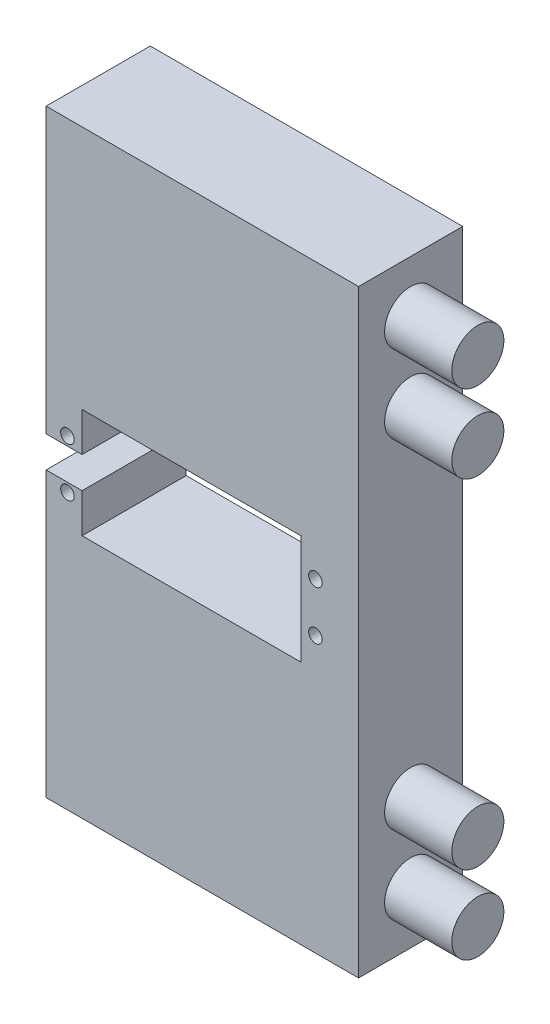
ISO-10303-21;
HEADER;
FILE_DESCRIPTION(('STEP AP214'),'2;1');
FILE_NAME('part.step','',(''),(''),'','','');
FILE_SCHEMA(('AUTOMOTIVE_DESIGN { 1 0 10303 214 1 1 1 1 }'));
ENDSEC;
DATA;
#1=APPLICATION_CONTEXT('core data for automotive mechanical design processes');
#2=APPLICATION_PROTOCOL_DEFINITION('international standard','automotive_design',2000,#1);
#3=PRODUCT_CONTEXT('',#1,'mechanical');
#4=PRODUCT('Part','Part','',(#3));
#5=PRODUCT_RELATED_PRODUCT_CATEGORY('part','',(#4));
#6=PRODUCT_DEFINITION_FORMATION('','',#4);
#7=PRODUCT_DEFINITION_CONTEXT('part definition',#1,'design');
#8=PRODUCT_DEFINITION('design','',#6,#7);
#9=PRODUCT_DEFINITION_SHAPE('','',#8);
#10=(LENGTH_UNIT() NAMED_UNIT(*) SI_UNIT(.MILLI.,.METRE.));
#11=(NAMED_UNIT(*) PLANE_ANGLE_UNIT() SI_UNIT($,.RADIAN.));
#12=(NAMED_UNIT(*) SI_UNIT($,.STERADIAN.) SOLID_ANGLE_UNIT());
#13=UNCERTAINTY_MEASURE_WITH_UNIT(LENGTH_MEASURE(1.E-05),#10,'distance_accuracy_value','');
#14=(GEOMETRIC_REPRESENTATION_CONTEXT(3) GLOBAL_UNCERTAINTY_ASSIGNED_CONTEXT((#13)) GLOBAL_UNIT_ASSIGNED_CONTEXT((#10,
#11,#12)) REPRESENTATION_CONTEXT('',''));
#15=CARTESIAN_POINT('',(0.,0.,0.));
#16=DIRECTION('',(0.,0.,1.));
#17=DIRECTION('',(1.,0.,0.));
#18=AXIS2_PLACEMENT_3D('',#15,#16,#17);
#19=CARTESIAN_POINT('',(55.0953192291233,54.5,20.));
#20=DIRECTION('',(1.,0.,0.));
#21=DIRECTION('',(0.,1.,0.));
#22=AXIS2_PLACEMENT_3D('',#19,#20,#21);
#23=PLANE('',#22);
#24=DIRECTION('',(0.,0.,1.));
#25=VECTOR('',#24,1.);
#26=CARTESIAN_POINT('',(55.0953192291233,-6.,20.));
#27=LINE('',#26,#25);
#28=CARTESIAN_POINT('',(55.0953192291233,-6.,0.));
#29=VERTEX_POINT('',#28);
#30=CARTESIAN_POINT('',(55.0953192291233,-6.,20.));
#31=VERTEX_POINT('',#30);
#32=EDGE_CURVE('E208',#29,#31,#27,.T.);
#33=ORIENTED_EDGE('',*,*,#32,.F.);
#34=DIRECTION('',(0.,-1.,0.));
#35=VECTOR('',#34,1.);
#36=CARTESIAN_POINT('',(55.0953192291233,54.5,0.));
#37=LINE('',#36,#35);
#38=CARTESIAN_POINT('',(55.0953192291233,-60.5,0.));
#39=VERTEX_POINT('',#38);
#40=EDGE_CURVE('E285',#29,#39,#37,.T.);
#41=ORIENTED_EDGE('',*,*,#40,.T.);
#42=DIRECTION('',(0.,0.,-1.));
#43=VECTOR('',#42,1.);
#44=CARTESIAN_POINT('',(55.0953192291233,-60.5,20.));
#45=LINE('',#44,#43);
#46=CARTESIAN_POINT('',(55.0953192291233,-60.5,20.));
#47=VERTEX_POINT('',#46);
#48=EDGE_CURVE('E319',#47,#39,#45,.T.);
#49=ORIENTED_EDGE('',*,*,#48,.F.);
#50=DIRECTION('',(0.,-1.,0.));
#51=VECTOR('',#50,1.);
#52=CARTESIAN_POINT('',(55.0953192291233,54.5,20.));
#53=LINE('',#52,#51);
#54=EDGE_CURVE('E156',#31,#47,#53,.T.);
#55=ORIENTED_EDGE('',*,*,#54,.F.);
#56=EDGE_LOOP('',(#33,#41,#49,#55));
#57=FACE_BOUND('',#56,.T.);
#58=ADVANCED_FACE('F103',(#57),#23,.F.);
#59=CARTESIAN_POINT('',(0.,0.,20.));
#60=DIRECTION('',(0.,0.,1.));
#61=DIRECTION('',(1.,0.,0.));
#62=AXIS2_PLACEMENT_3D('',#59,#60,#61);
#63=PLANE('',#62);
#64=CARTESIAN_POINT('',(106.81,1.7,20.));
#65=DIRECTION('',(0.,0.,1.));
#66=DIRECTION('',(1.,0.,0.));
#67=AXIS2_PLACEMENT_3D('',#64,#65,#66);
#68=CIRCLE('',#67,1.29999999999999);
#69=CARTESIAN_POINT('',(108.11,1.7,20.));
#70=VERTEX_POINT('',#69);
#71=EDGE_CURVE('E694',#70,#70,#68,.T.);
#72=ORIENTED_EDGE('',*,*,#71,.F.);
#73=EDGE_LOOP('',(#72));
#74=FACE_BOUND('',#73,.T.);
#75=DIRECTION('',(0.,-1.,0.));
#76=VECTOR('',#75,1.);
#77=CARTESIAN_POINT('',(62.,-6.,20.));
#78=LINE('',#77,#76);
#79=CARTESIAN_POINT('',(62.,-6.,20.));
#80=VERTEX_POINT('',#79);
#81=CARTESIAN_POINT('',(62.,-13.5,20.));
#82=VERTEX_POINT('',#81);
#83=EDGE_CURVE('E211',#80,#82,#78,.T.);
#84=ORIENTED_EDGE('',*,*,#83,.F.);
#85=DIRECTION('',(1.,0.,0.));
#86=VECTOR('',#85,1.);
#87=CARTESIAN_POINT('',(55.,-6.,20.));
#88=LINE('',#87,#86);
#89=EDGE_CURVE('E202',#31,#80,#88,.T.);
#90=ORIENTED_EDGE('',*,*,#89,.F.);
#91=ORIENTED_EDGE('',*,*,#54,.T.);
#92=DIRECTION('',(1.,0.,0.));
#93=VECTOR('',#92,1.);
#94=CARTESIAN_POINT('',(55.0953192291233,-60.5,20.));
#95=LINE('',#94,#93);
#96=CARTESIAN_POINT('',(115.095319229123,-60.5,20.));
#97=VERTEX_POINT('',#96);
#98=EDGE_CURVE('E289',#47,#97,#95,.T.);
#99=ORIENTED_EDGE('',*,*,#98,.T.);
#100=DIRECTION('',(0.,1.,0.));
#101=VECTOR('',#100,1.);
#102=CARTESIAN_POINT('',(115.095319229123,54.5,20.));
#103=LINE('',#102,#101);
#104=CARTESIAN_POINT('',(115.095319229123,54.5,20.));
#105=VERTEX_POINT('',#104);
#106=EDGE_CURVE('E292',#97,#105,#103,.T.);
#107=ORIENTED_EDGE('',*,*,#106,.T.);
#108=DIRECTION('',(-1.,0.,0.));
#109=VECTOR('',#108,1.);
#110=CARTESIAN_POINT('',(55.0953192291233,54.5,20.));
#111=LINE('',#110,#109);
#112=CARTESIAN_POINT('',(55.0953192291233,54.5,20.));
#113=VERTEX_POINT('',#112);
#114=EDGE_CURVE('E128',#105,#113,#111,.T.);
#115=ORIENTED_EDGE('',*,*,#114,.T.);
#116=CARTESIAN_POINT('',(55.0953192291233,0.,20.));
#117=VERTEX_POINT('',#116);
#118=EDGE_CURVE('E286',#113,#117,#53,.T.);
#119=ORIENTED_EDGE('',*,*,#118,.T.);
#120=DIRECTION('',(1.,0.,0.));
#121=VECTOR('',#120,1.);
#122=CARTESIAN_POINT('',(55.,0.,20.));
#123=LINE('',#122,#121);
#124=CARTESIAN_POINT('',(62.,0.,20.));
#125=VERTEX_POINT('',#124);
#126=EDGE_CURVE('E244',#117,#125,#123,.T.);
#127=ORIENTED_EDGE('',*,*,#126,.T.);
#128=DIRECTION('',(0.,1.,0.));
#129=VECTOR('',#128,1.);
#130=CARTESIAN_POINT('',(62.,0.,20.));
#131=LINE('',#130,#129);
#132=CARTESIAN_POINT('',(62.,7.5,20.));
#133=VERTEX_POINT('',#132);
#134=EDGE_CURVE('E240',#125,#133,#131,.T.);
#135=ORIENTED_EDGE('',*,*,#134,.T.);
#136=DIRECTION('',(1.,0.,0.));
#137=VECTOR('',#136,1.);
#138=CARTESIAN_POINT('',(62.,7.5,20.));
#139=LINE('',#138,#137);
#140=CARTESIAN_POINT('',(104.,7.5,20.));
#141=VERTEX_POINT('',#140);
#142=EDGE_CURVE('E236',#133,#141,#139,.T.);
#143=ORIENTED_EDGE('',*,*,#142,.T.);
#144=DIRECTION('',(0.,-1.,0.));
#145=VECTOR('',#144,1.);
#146=CARTESIAN_POINT('',(104.,7.5,20.));
#147=LINE('',#146,#145);
#148=CARTESIAN_POINT('',(104.,-13.5,20.));
#149=VERTEX_POINT('',#148);
#150=EDGE_CURVE('E230',#141,#149,#147,.T.);
#151=ORIENTED_EDGE('',*,*,#150,.T.);
#152=DIRECTION('',(1.,0.,0.));
#153=VECTOR('',#152,1.);
#154=CARTESIAN_POINT('',(62.,-13.5,20.));
#155=LINE('',#154,#153);
#156=EDGE_CURVE('E226',#82,#149,#155,.T.);
#157=ORIENTED_EDGE('',*,*,#156,.F.);
#158=EDGE_LOOP('',(#84,#90,#91,#99,#107,#115,#119,#127,#135,#143,#151,#157));
#159=FACE_BOUND('',#158,.T.);
#160=CARTESIAN_POINT('',(106.81,-7.7,20.));
#161=DIRECTION('',(0.,0.,-1.));
#162=DIRECTION('',(-1.,0.,0.));
#163=AXIS2_PLACEMENT_3D('',#160,#161,#162);
#164=CIRCLE('',#163,1.29999999999999);
#165=CARTESIAN_POINT('',(105.51,-7.7,20.));
#166=VERTEX_POINT('',#165);
#167=EDGE_CURVE('E702',#166,#166,#164,.T.);
#168=ORIENTED_EDGE('',*,*,#167,.T.);
#169=EDGE_LOOP('',(#168));
#170=FACE_BOUND('',#169,.T.);
#171=CARTESIAN_POINT('',(59.19,-7.7,20.));
#172=DIRECTION('',(0.,0.,-1.));
#173=DIRECTION('',(-1.,0.,0.));
#174=AXIS2_PLACEMENT_3D('',#171,#172,#173);
#175=CIRCLE('',#174,1.3);
#176=CARTESIAN_POINT('',(57.89,-7.7,20.));
#177=VERTEX_POINT('',#176);
#178=EDGE_CURVE('E710',#177,#177,#175,.T.);
#179=ORIENTED_EDGE('',*,*,#178,.T.);
#180=EDGE_LOOP('',(#179));
#181=FACE_BOUND('',#180,.T.);
#182=CARTESIAN_POINT('',(59.19,1.7,20.));
#183=DIRECTION('',(0.,0.,1.));
#184=DIRECTION('',(1.,0.,0.));
#185=AXIS2_PLACEMENT_3D('',#182,#183,#184);
#186=CIRCLE('',#185,1.3);
#187=CARTESIAN_POINT('',(60.49,1.7,20.));
#188=VERTEX_POINT('',#187);
#189=EDGE_CURVE('E690',#188,#188,#186,.T.);
#190=ORIENTED_EDGE('',*,*,#189,.F.);
#191=EDGE_LOOP('',(#190));
#192=FACE_BOUND('',#191,.T.);
#193=ADVANCED_FACE('F223',(#74,#159,#170,#181,#192),#63,.T.);
#194=CARTESIAN_POINT('',(0.,0.,0.));
#195=DIRECTION('',(0.,0.,1.));
#196=DIRECTION('',(1.,0.,0.));
#197=AXIS2_PLACEMENT_3D('',#194,#195,#196);
#198=PLANE('',#197);
#199=CARTESIAN_POINT('',(85.,-43.5,0.));
#200=DIRECTION('',(0.,0.,-1.));
#201=DIRECTION('',(-1.,0.,0.));
#202=AXIS2_PLACEMENT_3D('',#199,#200,#201);
#203=CIRCLE('',#202,9.5);
#204=CARTESIAN_POINT('',(75.5,-43.5,0.));
#205=VERTEX_POINT('',#204);
#206=EDGE_CURVE('E661',#205,#205,#203,.T.);
#207=ORIENTED_EDGE('',*,*,#206,.F.);
#208=EDGE_LOOP('',(#207));
#209=FACE_BOUND('',#208,.T.);
#210=CARTESIAN_POINT('',(85.,37.5,0.));
#211=DIRECTION('',(0.,0.,1.));
#212=DIRECTION('',(1.,0.,0.));
#213=AXIS2_PLACEMENT_3D('',#210,#211,#212);
#214=CIRCLE('',#213,9.5);
#215=CARTESIAN_POINT('',(94.5,37.5,0.));
#216=VERTEX_POINT('',#215);
#217=EDGE_CURVE('E660',#216,#216,#214,.T.);
#218=ORIENTED_EDGE('',*,*,#217,.T.);
#219=EDGE_LOOP('',(#218));
#220=FACE_BOUND('',#219,.T.);
#221=CARTESIAN_POINT('',(59.19,-7.7,0.));
#222=DIRECTION('',(0.,0.,-1.));
#223=DIRECTION('',(-1.,0.,0.));
#224=AXIS2_PLACEMENT_3D('',#221,#222,#223);
#225=CIRCLE('',#224,1.3);
#226=CARTESIAN_POINT('',(57.89,-7.7,0.));
#227=VERTEX_POINT('',#226);
#228=EDGE_CURVE('E706',#227,#227,#225,.T.);
#229=ORIENTED_EDGE('',*,*,#228,.F.);
#230=EDGE_LOOP('',(#229));
#231=FACE_BOUND('',#230,.T.);
#232=CARTESIAN_POINT('',(106.81,-7.7,0.));
#233=DIRECTION('',(0.,0.,-1.));
#234=DIRECTION('',(-1.,0.,0.));
#235=AXIS2_PLACEMENT_3D('',#232,#233,#234);
#236=CIRCLE('',#235,1.29999999999999);
#237=CARTESIAN_POINT('',(105.51,-7.7,0.));
#238=VERTEX_POINT('',#237);
#239=EDGE_CURVE('E698',#238,#238,#236,.T.);
#240=ORIENTED_EDGE('',*,*,#239,.F.);
#241=EDGE_LOOP('',(#240));
#242=FACE_BOUND('',#241,.T.);
#243=DIRECTION('',(-1.,0.,0.));
#244=VECTOR('',#243,1.);
#245=CARTESIAN_POINT('',(0.,-6.,0.));
#246=LINE('',#245,#244);
#247=CARTESIAN_POINT('',(62.,-6.,0.));
#248=VERTEX_POINT('',#247);
#249=EDGE_CURVE('E326',#248,#29,#246,.T.);
#250=ORIENTED_EDGE('',*,*,#249,.F.);
#251=DIRECTION('',(0.,-1.,0.));
#252=VECTOR('',#251,1.);
#253=CARTESIAN_POINT('',(62.,-6.,0.));
#254=LINE('',#253,#252);
#255=CARTESIAN_POINT('',(62.,-13.5,0.));
#256=VERTEX_POINT('',#255);
#257=EDGE_CURVE('E218',#248,#256,#254,.T.);
#258=ORIENTED_EDGE('',*,*,#257,.T.);
#259=DIRECTION('',(1.,0.,0.));
#260=VECTOR('',#259,1.);
#261=CARTESIAN_POINT('',(62.,-13.5,0.));
#262=LINE('',#261,#260);
#263=CARTESIAN_POINT('',(104.,-13.5,0.));
#264=VERTEX_POINT('',#263);
#265=EDGE_CURVE('E251',#256,#264,#262,.T.);
#266=ORIENTED_EDGE('',*,*,#265,.T.);
#267=DIRECTION('',(0.,-1.,0.));
#268=VECTOR('',#267,1.);
#269=CARTESIAN_POINT('',(104.,7.5,0.));
#270=LINE('',#269,#268);
#271=CARTESIAN_POINT('',(104.,7.5,0.));
#272=VERTEX_POINT('',#271);
#273=EDGE_CURVE('E256',#272,#264,#270,.T.);
#274=ORIENTED_EDGE('',*,*,#273,.F.);
#275=DIRECTION('',(1.,0.,0.));
#276=VECTOR('',#275,1.);
#277=CARTESIAN_POINT('',(62.,7.5,0.));
#278=LINE('',#277,#276);
#279=CARTESIAN_POINT('',(62.,7.5,0.));
#280=VERTEX_POINT('',#279);
#281=EDGE_CURVE('E260',#280,#272,#278,.T.);
#282=ORIENTED_EDGE('',*,*,#281,.F.);
#283=DIRECTION('',(0.,1.,0.));
#284=VECTOR('',#283,1.);
#285=CARTESIAN_POINT('',(62.,0.,0.));
#286=LINE('',#285,#284);
#287=CARTESIAN_POINT('',(62.,0.,0.));
#288=VERTEX_POINT('',#287);
#289=EDGE_CURVE('E212',#288,#280,#286,.T.);
#290=ORIENTED_EDGE('',*,*,#289,.F.);
#291=DIRECTION('',(-1.,0.,0.));
#292=VECTOR('',#291,1.);
#293=CARTESIAN_POINT('',(0.,0.,0.));
#294=LINE('',#293,#292);
#295=CARTESIAN_POINT('',(55.0953192291233,0.,0.));
#296=VERTEX_POINT('',#295);
#297=EDGE_CURVE('E323',#288,#296,#294,.T.);
#298=ORIENTED_EDGE('',*,*,#297,.T.);
#299=CARTESIAN_POINT('',(55.0953192291233,54.5,0.));
#300=VERTEX_POINT('',#299);
#301=EDGE_CURVE('E298',#300,#296,#37,.T.);
#302=ORIENTED_EDGE('',*,*,#301,.F.);
#303=DIRECTION('',(-1.,0.,0.));
#304=VECTOR('',#303,1.);
#305=CARTESIAN_POINT('',(55.0953192291233,54.5,0.));
#306=LINE('',#305,#304);
#307=CARTESIAN_POINT('',(115.095319229123,54.5,0.));
#308=VERTEX_POINT('',#307);
#309=EDGE_CURVE('E149',#308,#300,#306,.T.);
#310=ORIENTED_EDGE('',*,*,#309,.F.);
#311=DIRECTION('',(0.,1.,0.));
#312=VECTOR('',#311,1.);
#313=CARTESIAN_POINT('',(115.095319229123,54.5,0.));
#314=LINE('',#313,#312);
#315=CARTESIAN_POINT('',(115.095319229123,-60.5,0.));
#316=VERTEX_POINT('',#315);
#317=EDGE_CURVE('E305',#316,#308,#314,.T.);
#318=ORIENTED_EDGE('',*,*,#317,.F.);
#319=DIRECTION('',(1.,0.,0.));
#320=VECTOR('',#319,1.);
#321=CARTESIAN_POINT('',(55.0953192291233,-60.5,0.));
#322=LINE('',#321,#320);
#323=EDGE_CURVE('E302',#39,#316,#322,.T.);
#324=ORIENTED_EDGE('',*,*,#323,.F.);
#325=ORIENTED_EDGE('',*,*,#40,.F.);
#326=EDGE_LOOP('',(#250,#258,#266,#274,#282,#290,#298,#302,#310,#318,#324,#325));
#327=FACE_BOUND('',#326,.T.);
#328=CARTESIAN_POINT('',(106.81,1.7,0.));
#329=DIRECTION('',(0.,0.,1.));
#330=DIRECTION('',(1.,0.,0.));
#331=AXIS2_PLACEMENT_3D('',#328,#329,#330);
#332=CIRCLE('',#331,1.29999999999999);
#333=CARTESIAN_POINT('',(108.11,1.7,0.));
#334=VERTEX_POINT('',#333);
#335=EDGE_CURVE('E252',#334,#334,#332,.T.);
#336=ORIENTED_EDGE('',*,*,#335,.T.);
#337=EDGE_LOOP('',(#336));
#338=FACE_BOUND('',#337,.T.);
#339=CARTESIAN_POINT('',(59.19,1.7,0.));
#340=DIRECTION('',(0.,0.,1.));
#341=DIRECTION('',(1.,0.,0.));
#342=AXIS2_PLACEMENT_3D('',#339,#340,#341);
#343=CIRCLE('',#342,1.3);
#344=CARTESIAN_POINT('',(60.49,1.7,0.));
#345=VERTEX_POINT('',#344);
#346=EDGE_CURVE('E714',#345,#345,#343,.T.);
#347=ORIENTED_EDGE('',*,*,#346,.T.);
#348=EDGE_LOOP('',(#347));
#349=FACE_BOUND('',#348,.T.);
#350=ADVANCED_FACE('F360',(#209,#220,#231,#242,#327,#338,#349),#198,.F.);
#351=ORIENTED_EDGE('',*,*,#301,.T.);
#352=DIRECTION('',(0.,0.,1.));
#353=VECTOR('',#352,1.);
#354=CARTESIAN_POINT('',(55.0953192291233,0.,20.));
#355=LINE('',#354,#353);
#356=EDGE_CURVE('E119',#296,#117,#355,.T.);
#357=ORIENTED_EDGE('',*,*,#356,.T.);
#358=ORIENTED_EDGE('',*,*,#118,.F.);
#359=DIRECTION('',(0.,0.,-1.));
#360=VECTOR('',#359,1.);
#361=CARTESIAN_POINT('',(55.0953192291233,54.5,20.));
#362=LINE('',#361,#360);
#363=EDGE_CURVE('E297',#113,#300,#362,.T.);
#364=ORIENTED_EDGE('',*,*,#363,.T.);
#365=EDGE_LOOP('',(#351,#357,#358,#364));
#366=FACE_BOUND('',#365,.T.);
#367=ADVANCED_FACE('F105',(#366),#23,.F.);
#368=CARTESIAN_POINT('',(55.0953192291233,-60.5,20.));
#369=DIRECTION('',(0.,1.,0.));
#370=DIRECTION('',(-1.,0.,0.));
#371=AXIS2_PLACEMENT_3D('',#368,#369,#370);
#372=PLANE('',#371);
#373=ORIENTED_EDGE('',*,*,#323,.T.);
#374=DIRECTION('',(0.,0.,-1.));
#375=VECTOR('',#374,1.);
#376=CARTESIAN_POINT('',(115.095319229123,-60.5,20.));
#377=LINE('',#376,#375);
#378=EDGE_CURVE('E315',#97,#316,#377,.T.);
#379=ORIENTED_EDGE('',*,*,#378,.F.);
#380=ORIENTED_EDGE('',*,*,#98,.F.);
#381=ORIENTED_EDGE('',*,*,#48,.T.);
#382=EDGE_LOOP('',(#373,#379,#380,#381));
#383=FACE_BOUND('',#382,.T.);
#384=ADVANCED_FACE('F346',(#383),#372,.F.);
#385=CARTESIAN_POINT('',(115.095319229123,54.5,20.));
#386=DIRECTION('',(-1.,0.,0.));
#387=DIRECTION('',(0.,-1.,0.));
#388=AXIS2_PLACEMENT_3D('',#385,#386,#387);
#389=PLANE('',#388);
#390=CARTESIAN_POINT('',(115.095319229123,-50.5,10.));
#391=DIRECTION('',(-1.,0.,0.));
#392=DIRECTION('',(0.,-1.,0.));
#393=AXIS2_PLACEMENT_3D('',#390,#391,#392);
#394=CIRCLE('',#393,5.);
#395=CARTESIAN_POINT('',(115.095319229123,-55.5,10.));
#396=VERTEX_POINT('',#395);
#397=EDGE_CURVE('E12',#396,#396,#394,.F.);
#398=ORIENTED_EDGE('',*,*,#397,.F.);
#399=EDGE_LOOP('',(#398));
#400=FACE_BOUND('',#399,.T.);
#401=CARTESIAN_POINT('',(115.095319229123,-35.5,10.));
#402=DIRECTION('',(-1.,0.,0.));
#403=DIRECTION('',(0.,-1.,0.));
#404=AXIS2_PLACEMENT_3D('',#401,#402,#403);
#405=CIRCLE('',#404,5.);
#406=CARTESIAN_POINT('',(115.095319229123,-40.5,10.));
#407=VERTEX_POINT('',#406);
#408=EDGE_CURVE('E112',#407,#407,#405,.F.);
#409=ORIENTED_EDGE('',*,*,#408,.F.);
#410=EDGE_LOOP('',(#409));
#411=FACE_BOUND('',#410,.T.);
#412=CARTESIAN_POINT('',(115.095319229123,29.5,10.));
#413=DIRECTION('',(-1.,0.,0.));
#414=DIRECTION('',(0.,-1.,0.));
#415=AXIS2_PLACEMENT_3D('',#412,#413,#414);
#416=CIRCLE('',#415,5.);
#417=CARTESIAN_POINT('',(115.095319229123,24.5,10.));
#418=VERTEX_POINT('',#417);
#419=EDGE_CURVE('E333',#418,#418,#416,.F.);
#420=ORIENTED_EDGE('',*,*,#419,.F.);
#421=EDGE_LOOP('',(#420));
#422=FACE_BOUND('',#421,.T.);
#423=CARTESIAN_POINT('',(115.095319229123,44.5,10.));
#424=DIRECTION('',(-1.,0.,0.));
#425=DIRECTION('',(0.,-1.,0.));
#426=AXIS2_PLACEMENT_3D('',#423,#424,#425);
#427=CIRCLE('',#426,5.);
#428=CARTESIAN_POINT('',(115.095319229123,39.5,10.));
#429=VERTEX_POINT('',#428);
#430=EDGE_CURVE('E329',#429,#429,#427,.F.);
#431=ORIENTED_EDGE('',*,*,#430,.F.);
#432=EDGE_LOOP('',(#431));
#433=FACE_BOUND('',#432,.T.);
#434=ORIENTED_EDGE('',*,*,#317,.T.);
#435=DIRECTION('',(0.,0.,-1.));
#436=VECTOR('',#435,1.);
#437=CARTESIAN_POINT('',(115.095319229123,54.5,20.));
#438=LINE('',#437,#436);
#439=EDGE_CURVE('E312',#105,#308,#438,.T.);
#440=ORIENTED_EDGE('',*,*,#439,.F.);
#441=ORIENTED_EDGE('',*,*,#106,.F.);
#442=ORIENTED_EDGE('',*,*,#378,.T.);
#443=EDGE_LOOP('',(#434,#440,#441,#442));
#444=FACE_BOUND('',#443,.T.);
#445=ADVANCED_FACE('F342',(#400,#411,#422,#433,#444),#389,.F.);
#446=CARTESIAN_POINT('',(55.0953192291233,54.5,20.));
#447=DIRECTION('',(0.,-1.,0.));
#448=DIRECTION('',(0.,0.,-1.));
#449=AXIS2_PLACEMENT_3D('',#446,#447,#448);
#450=PLANE('',#449);
#451=ORIENTED_EDGE('',*,*,#309,.T.);
#452=ORIENTED_EDGE('',*,*,#363,.F.);
#453=ORIENTED_EDGE('',*,*,#114,.F.);
#454=ORIENTED_EDGE('',*,*,#439,.T.);
#455=EDGE_LOOP('',(#451,#452,#453,#454));
#456=FACE_BOUND('',#455,.T.);
#457=ADVANCED_FACE('F345',(#456),#450,.F.);
#458=CARTESIAN_POINT('',(55.,-6.,20.));
#459=DIRECTION('',(0.,1.,0.));
#460=DIRECTION('',(0.,0.,1.));
#461=AXIS2_PLACEMENT_3D('',#458,#459,#460);
#462=PLANE('',#461);
#463=ORIENTED_EDGE('',*,*,#32,.T.);
#464=ORIENTED_EDGE('',*,*,#89,.T.);
#465=DIRECTION('',(0.,0.,-1.));
#466=VECTOR('',#465,1.);
#467=CARTESIAN_POINT('',(62.,-6.,20.));
#468=LINE('',#467,#466);
#469=EDGE_CURVE('E205',#80,#248,#468,.T.);
#470=ORIENTED_EDGE('',*,*,#469,.T.);
#471=ORIENTED_EDGE('',*,*,#249,.T.);
#472=EDGE_LOOP('',(#463,#464,#470,#471));
#473=FACE_BOUND('',#472,.T.);
#474=ADVANCED_FACE('F204',(#473),#462,.T.);
#475=CARTESIAN_POINT('',(55.,0.,20.));
#476=DIRECTION('',(0.,1.,0.));
#477=DIRECTION('',(0.,0.,1.));
#478=AXIS2_PLACEMENT_3D('',#475,#476,#477);
#479=PLANE('',#478);
#480=ORIENTED_EDGE('',*,*,#297,.F.);
#481=DIRECTION('',(0.,0.,-1.));
#482=VECTOR('',#481,1.);
#483=CARTESIAN_POINT('',(62.,0.,20.));
#484=LINE('',#483,#482);
#485=EDGE_CURVE('E248',#125,#288,#484,.T.);
#486=ORIENTED_EDGE('',*,*,#485,.F.);
#487=ORIENTED_EDGE('',*,*,#126,.F.);
#488=ORIENTED_EDGE('',*,*,#356,.F.);
#489=EDGE_LOOP('',(#480,#486,#487,#488));
#490=FACE_BOUND('',#489,.T.);
#491=ADVANCED_FACE('F366',(#490),#479,.F.);
#492=CARTESIAN_POINT('',(62.,-6.,20.));
#493=DIRECTION('',(1.,0.,0.));
#494=DIRECTION('',(0.,1.,0.));
#495=AXIS2_PLACEMENT_3D('',#492,#493,#494);
#496=PLANE('',#495);
#497=ORIENTED_EDGE('',*,*,#257,.F.);
#498=ORIENTED_EDGE('',*,*,#469,.F.);
#499=ORIENTED_EDGE('',*,*,#83,.T.);
#500=DIRECTION('',(0.,0.,-1.));
#501=VECTOR('',#500,1.);
#502=CARTESIAN_POINT('',(62.,-13.5,20.));
#503=LINE('',#502,#501);
#504=EDGE_CURVE('E220',#82,#256,#503,.T.);
#505=ORIENTED_EDGE('',*,*,#504,.T.);
#506=EDGE_LOOP('',(#497,#498,#499,#505));
#507=FACE_BOUND('',#506,.T.);
#508=ADVANCED_FACE('F215',(#507),#496,.T.);
#509=CARTESIAN_POINT('',(62.,-13.5,20.));
#510=DIRECTION('',(0.,1.,0.));
#511=DIRECTION('',(0.,0.,1.));
#512=AXIS2_PLACEMENT_3D('',#509,#510,#511);
#513=PLANE('',#512);
#514=ORIENTED_EDGE('',*,*,#265,.F.);
#515=ORIENTED_EDGE('',*,*,#504,.F.);
#516=ORIENTED_EDGE('',*,*,#156,.T.);
#517=DIRECTION('',(0.,0.,-1.));
#518=VECTOR('',#517,1.);
#519=CARTESIAN_POINT('',(104.,-13.5,20.));
#520=LINE('',#519,#518);
#521=EDGE_CURVE('E276',#149,#264,#520,.T.);
#522=ORIENTED_EDGE('',*,*,#521,.T.);
#523=EDGE_LOOP('',(#514,#515,#516,#522));
#524=FACE_BOUND('',#523,.T.);
#525=ADVANCED_FACE('F380',(#524),#513,.T.);
#526=CARTESIAN_POINT('',(104.,7.5,20.));
#527=DIRECTION('',(1.,0.,0.));
#528=DIRECTION('',(0.,0.,-1.));
#529=AXIS2_PLACEMENT_3D('',#526,#527,#528);
#530=PLANE('',#529);
#531=ORIENTED_EDGE('',*,*,#273,.T.);
#532=ORIENTED_EDGE('',*,*,#521,.F.);
#533=ORIENTED_EDGE('',*,*,#150,.F.);
#534=DIRECTION('',(0.,0.,-1.));
#535=VECTOR('',#534,1.);
#536=CARTESIAN_POINT('',(104.,7.5,20.));
#537=LINE('',#536,#535);
#538=EDGE_CURVE('E273',#141,#272,#537,.T.);
#539=ORIENTED_EDGE('',*,*,#538,.T.);
#540=EDGE_LOOP('',(#531,#532,#533,#539));
#541=FACE_BOUND('',#540,.T.);
#542=ADVANCED_FACE('F376',(#541),#530,.F.);
#543=CARTESIAN_POINT('',(62.,7.5,20.));
#544=DIRECTION('',(0.,1.,0.));
#545=DIRECTION('',(0.,0.,1.));
#546=AXIS2_PLACEMENT_3D('',#543,#544,#545);
#547=PLANE('',#546);
#548=ORIENTED_EDGE('',*,*,#281,.T.);
#549=ORIENTED_EDGE('',*,*,#538,.F.);
#550=ORIENTED_EDGE('',*,*,#142,.F.);
#551=DIRECTION('',(0.,0.,-1.));
#552=VECTOR('',#551,1.);
#553=CARTESIAN_POINT('',(62.,7.5,20.));
#554=LINE('',#553,#552);
#555=EDGE_CURVE('E270',#133,#280,#554,.T.);
#556=ORIENTED_EDGE('',*,*,#555,.T.);
#557=EDGE_LOOP('',(#548,#549,#550,#556));
#558=FACE_BOUND('',#557,.T.);
#559=ADVANCED_FACE('F372',(#558),#547,.F.);
#560=CARTESIAN_POINT('',(62.,0.,20.));
#561=DIRECTION('',(-1.,0.,0.));
#562=DIRECTION('',(0.,-1.,0.));
#563=AXIS2_PLACEMENT_3D('',#560,#561,#562);
#564=PLANE('',#563);
#565=ORIENTED_EDGE('',*,*,#289,.T.);
#566=ORIENTED_EDGE('',*,*,#555,.F.);
#567=ORIENTED_EDGE('',*,*,#134,.F.);
#568=ORIENTED_EDGE('',*,*,#485,.T.);
#569=EDGE_LOOP('',(#565,#566,#567,#568));
#570=FACE_BOUND('',#569,.T.);
#571=ADVANCED_FACE('F368',(#570),#564,.F.);
#572=CARTESIAN_POINT('',(106.81,1.7,20.));
#573=DIRECTION('',(0.,0.,-1.));
#574=DIRECTION('',(-1.,0.,0.));
#575=AXIS2_PLACEMENT_3D('',#572,#573,#574);
#576=CYLINDRICAL_SURFACE('',#575,1.29999999999999);
#577=ORIENTED_EDGE('',*,*,#71,.T.);
#578=EDGE_LOOP('',(#577));
#579=FACE_BOUND('',#578,.T.);
#580=ORIENTED_EDGE('',*,*,#335,.F.);
#581=EDGE_LOOP('',(#580));
#582=FACE_BOUND('',#581,.T.);
#583=ADVANCED_FACE('F423',(#579,#582),#576,.F.);
#584=CARTESIAN_POINT('',(106.81,-7.7,20.));
#585=DIRECTION('',(0.,0.,-1.));
#586=DIRECTION('',(-1.,0.,0.));
#587=AXIS2_PLACEMENT_3D('',#584,#585,#586);
#588=CYLINDRICAL_SURFACE('',#587,1.29999999999999);
#589=ORIENTED_EDGE('',*,*,#167,.F.);
#590=EDGE_LOOP('',(#589));
#591=FACE_BOUND('',#590,.T.);
#592=ORIENTED_EDGE('',*,*,#239,.T.);
#593=EDGE_LOOP('',(#592));
#594=FACE_BOUND('',#593,.T.);
#595=ADVANCED_FACE('F451',(#591,#594),#588,.F.);
#596=CARTESIAN_POINT('',(59.19,-7.7,20.));
#597=DIRECTION('',(0.,0.,-1.));
#598=DIRECTION('',(-1.,0.,0.));
#599=AXIS2_PLACEMENT_3D('',#596,#597,#598);
#600=CYLINDRICAL_SURFACE('',#599,1.3);
#601=ORIENTED_EDGE('',*,*,#178,.F.);
#602=EDGE_LOOP('',(#601));
#603=FACE_BOUND('',#602,.T.);
#604=ORIENTED_EDGE('',*,*,#228,.T.);
#605=EDGE_LOOP('',(#604));
#606=FACE_BOUND('',#605,.T.);
#607=ADVANCED_FACE('F459',(#603,#606),#600,.F.);
#608=CARTESIAN_POINT('',(59.19,1.7,20.));
#609=DIRECTION('',(0.,0.,-1.));
#610=DIRECTION('',(-1.,0.,0.));
#611=AXIS2_PLACEMENT_3D('',#608,#609,#610);
#612=CYLINDRICAL_SURFACE('',#611,1.3);
#613=ORIENTED_EDGE('',*,*,#189,.T.);
#614=EDGE_LOOP('',(#613));
#615=FACE_BOUND('',#614,.T.);
#616=ORIENTED_EDGE('',*,*,#346,.F.);
#617=EDGE_LOOP('',(#616));
#618=FACE_BOUND('',#617,.T.);
#619=ADVANCED_FACE('F419',(#615,#618),#612,.F.);
#620=CARTESIAN_POINT('',(128.,44.5,10.));
#621=DIRECTION('',(-1.,0.,0.));
#622=DIRECTION('',(0.,0.,1.));
#623=AXIS2_PLACEMENT_3D('',#620,#621,#622);
#624=CYLINDRICAL_SURFACE('',#623,5.);
#625=CARTESIAN_POINT('',(128.,44.5,10.));
#626=DIRECTION('',(1.,0.,0.));
#627=DIRECTION('',(0.,0.,-1.));
#628=AXIS2_PLACEMENT_3D('',#625,#626,#627);
#629=CIRCLE('',#628,5.);
#630=CARTESIAN_POINT('',(128.,44.5,5.00000000000001));
#631=VERTEX_POINT('',#630);
#632=EDGE_CURVE('E686',#631,#631,#629,.T.);
#633=ORIENTED_EDGE('',*,*,#632,.F.);
#634=EDGE_LOOP('',(#633));
#635=FACE_BOUND('',#634,.T.);
#636=ORIENTED_EDGE('',*,*,#430,.T.);
#637=EDGE_LOOP('',(#636));
#638=FACE_BOUND('',#637,.T.);
#639=ADVANCED_FACE('F473',(#635,#638),#624,.T.);
#640=CARTESIAN_POINT('',(128.,44.5,10.));
#641=DIRECTION('',(1.,0.,0.));
#642=DIRECTION('',(0.,0.,-1.));
#643=AXIS2_PLACEMENT_3D('',#640,#641,#642);
#644=PLANE('',#643);
#645=ORIENTED_EDGE('',*,*,#632,.T.);
#646=EDGE_LOOP('',(#645));
#647=FACE_BOUND('',#646,.T.);
#648=ADVANCED_FACE('F481',(#647),#644,.T.);
#649=CARTESIAN_POINT('',(128.,29.5,10.));
#650=DIRECTION('',(-1.,0.,0.));
#651=DIRECTION('',(0.,0.,1.));
#652=AXIS2_PLACEMENT_3D('',#649,#650,#651);
#653=CYLINDRICAL_SURFACE('',#652,5.);
#654=CARTESIAN_POINT('',(128.,29.5,10.));
#655=DIRECTION('',(1.,0.,0.));
#656=DIRECTION('',(0.,0.,-1.));
#657=AXIS2_PLACEMENT_3D('',#654,#655,#656);
#658=CIRCLE('',#657,5.);
#659=CARTESIAN_POINT('',(128.,29.5,5.00000000000001));
#660=VERTEX_POINT('',#659);
#661=EDGE_CURVE('E682',#660,#660,#658,.T.);
#662=ORIENTED_EDGE('',*,*,#661,.F.);
#663=EDGE_LOOP('',(#662));
#664=FACE_BOUND('',#663,.T.);
#665=ORIENTED_EDGE('',*,*,#419,.T.);
#666=EDGE_LOOP('',(#665));
#667=FACE_BOUND('',#666,.T.);
#668=ADVANCED_FACE('F489',(#664,#667),#653,.T.);
#669=CARTESIAN_POINT('',(128.,29.5,10.));
#670=DIRECTION('',(1.,0.,0.));
#671=DIRECTION('',(0.,0.,-1.));
#672=AXIS2_PLACEMENT_3D('',#669,#670,#671);
#673=PLANE('',#672);
#674=ORIENTED_EDGE('',*,*,#661,.T.);
#675=EDGE_LOOP('',(#674));
#676=FACE_BOUND('',#675,.T.);
#677=ADVANCED_FACE('F497',(#676),#673,.T.);
#678=CARTESIAN_POINT('',(128.,-35.5,10.));
#679=DIRECTION('',(-1.,0.,0.));
#680=DIRECTION('',(0.,0.,1.));
#681=AXIS2_PLACEMENT_3D('',#678,#679,#680);
#682=CYLINDRICAL_SURFACE('',#681,5.);
#683=CARTESIAN_POINT('',(128.,-35.5,10.));
#684=DIRECTION('',(1.,0.,0.));
#685=DIRECTION('',(0.,0.,1.));
#686=AXIS2_PLACEMENT_3D('',#683,#684,#685);
#687=CIRCLE('',#686,5.);
#688=CARTESIAN_POINT('',(128.,-35.5,15.));
#689=VERTEX_POINT('',#688);
#690=EDGE_CURVE('E678',#689,#689,#687,.T.);
#691=ORIENTED_EDGE('',*,*,#690,.F.);
#692=EDGE_LOOP('',(#691));
#693=FACE_BOUND('',#692,.T.);
#694=ORIENTED_EDGE('',*,*,#408,.T.);
#695=EDGE_LOOP('',(#694));
#696=FACE_BOUND('',#695,.T.);
#697=ADVANCED_FACE('F340',(#693,#696),#682,.T.);
#698=CARTESIAN_POINT('',(128.,-35.5,10.));
#699=DIRECTION('',(-1.,0.,0.));
#700=DIRECTION('',(0.,0.,1.));
#701=AXIS2_PLACEMENT_3D('',#698,#699,#700);
#702=PLANE('',#701);
#703=ORIENTED_EDGE('',*,*,#690,.T.);
#704=EDGE_LOOP('',(#703));
#705=FACE_BOUND('',#704,.T.);
#706=ADVANCED_FACE('F512',(#705),#702,.F.);
#707=CARTESIAN_POINT('',(128.,-50.5,10.));
#708=DIRECTION('',(-1.,0.,0.));
#709=DIRECTION('',(0.,0.,1.));
#710=AXIS2_PLACEMENT_3D('',#707,#708,#709);
#711=CYLINDRICAL_SURFACE('',#710,5.);
#712=CARTESIAN_POINT('',(128.,-50.5,10.));
#713=DIRECTION('',(1.,0.,0.));
#714=DIRECTION('',(0.,0.,1.));
#715=AXIS2_PLACEMENT_3D('',#712,#713,#714);
#716=CIRCLE('',#715,5.);
#717=CARTESIAN_POINT('',(128.,-50.5,15.));
#718=VERTEX_POINT('',#717);
#719=EDGE_CURVE('E673',#718,#718,#716,.T.);
#720=ORIENTED_EDGE('',*,*,#719,.F.);
#721=EDGE_LOOP('',(#720));
#722=FACE_BOUND('',#721,.T.);
#723=ORIENTED_EDGE('',*,*,#397,.T.);
#724=EDGE_LOOP('',(#723));
#725=FACE_BOUND('',#724,.T.);
#726=ADVANCED_FACE('F520',(#722,#725),#711,.T.);
#727=CARTESIAN_POINT('',(128.,-50.5,10.));
#728=DIRECTION('',(-1.,0.,0.));
#729=DIRECTION('',(0.,0.,1.));
#730=AXIS2_PLACEMENT_3D('',#727,#728,#729);
#731=PLANE('',#730);
#732=ORIENTED_EDGE('',*,*,#719,.T.);
#733=EDGE_LOOP('',(#732));
#734=FACE_BOUND('',#733,.T.);
#735=ADVANCED_FACE('F528',(#734),#731,.F.);
#736=CARTESIAN_POINT('',(85.,37.5,15.));
#737=DIRECTION('',(0.,0.,-1.));
#738=DIRECTION('',(-1.,0.,0.));
#739=AXIS2_PLACEMENT_3D('',#736,#737,#738);
#740=CYLINDRICAL_SURFACE('',#739,9.5);
#741=CARTESIAN_POINT('',(85.,37.5,15.));
#742=DIRECTION('',(0.,0.,1.));
#743=DIRECTION('',(1.,0.,0.));
#744=AXIS2_PLACEMENT_3D('',#741,#742,#743);
#745=CIRCLE('',#744,9.5);
#746=CARTESIAN_POINT('',(94.5,37.5,15.));
#747=VERTEX_POINT('',#746);
#748=EDGE_CURVE('E666',#747,#747,#745,.T.);
#749=ORIENTED_EDGE('',*,*,#748,.T.);
#750=EDGE_LOOP('',(#749));
#751=FACE_BOUND('',#750,.T.);
#752=ORIENTED_EDGE('',*,*,#217,.F.);
#753=EDGE_LOOP('',(#752));
#754=FACE_BOUND('',#753,.T.);
#755=ADVANCED_FACE('F536',(#751,#754),#740,.F.);
#756=CARTESIAN_POINT('',(85.,37.5,15.));
#757=DIRECTION('',(0.,0.,1.));
#758=DIRECTION('',(1.,0.,0.));
#759=AXIS2_PLACEMENT_3D('',#756,#757,#758);
#760=PLANE('',#759);
#761=ORIENTED_EDGE('',*,*,#748,.F.);
#762=EDGE_LOOP('',(#761));
#763=FACE_BOUND('',#762,.T.);
#764=ADVANCED_FACE('F544',(#763),#760,.F.);
#765=CARTESIAN_POINT('',(85.,-43.5,15.));
#766=DIRECTION('',(0.,0.,-1.));
#767=DIRECTION('',(-1.,0.,0.));
#768=AXIS2_PLACEMENT_3D('',#765,#766,#767);
#769=CYLINDRICAL_SURFACE('',#768,9.5);
#770=CARTESIAN_POINT('',(85.,-43.5,15.));
#771=DIRECTION('',(0.,0.,-1.));
#772=DIRECTION('',(-1.,0.,0.));
#773=AXIS2_PLACEMENT_3D('',#770,#771,#772);
#774=CIRCLE('',#773,9.5);
#775=CARTESIAN_POINT('',(75.5,-43.5,15.));
#776=VERTEX_POINT('',#775);
#777=EDGE_CURVE('E658',#776,#776,#774,.T.);
#778=ORIENTED_EDGE('',*,*,#777,.F.);
#779=EDGE_LOOP('',(#778));
#780=FACE_BOUND('',#779,.T.);
#781=ORIENTED_EDGE('',*,*,#206,.T.);
#782=EDGE_LOOP('',(#781));
#783=FACE_BOUND('',#782,.T.);
#784=ADVANCED_FACE('F552',(#780,#783),#769,.F.);
#785=CARTESIAN_POINT('',(85.,-43.5,15.));
#786=DIRECTION('',(0.,0.,-1.));
#787=DIRECTION('',(-1.,0.,0.));
#788=AXIS2_PLACEMENT_3D('',#785,#786,#787);
#789=PLANE('',#788);
#790=ORIENTED_EDGE('',*,*,#777,.T.);
#791=EDGE_LOOP('',(#790));
#792=FACE_BOUND('',#791,.T.);
#793=ADVANCED_FACE('F561',(#792),#789,.T.);
#794=CLOSED_SHELL('',(#58,#193,#350,#367,#384,#445,#457,#474,#491,#508,#525,#542,#559,#571,#583,
#595,#607,#619,#639,#648,#668,#677,#697,#706,#726,#735,#755,#764,#784,#793));
#795=MANIFOLD_SOLID_BREP('B2',#794);
#796=ADVANCED_BREP_SHAPE_REPRESENTATION('',(#18,#795),#14);
#797=SHAPE_DEFINITION_REPRESENTATION(#9,#796);
ENDSEC;
END-ISO-10303-21;
